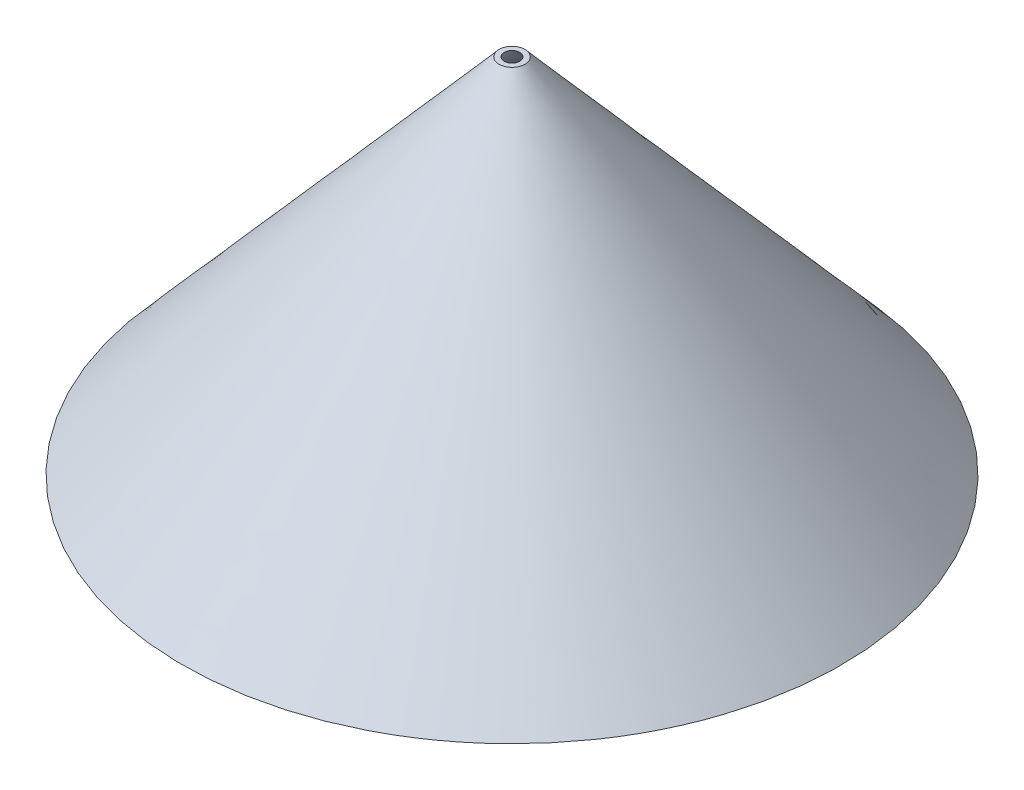
ISO-10303-21;
HEADER;
FILE_DESCRIPTION(('STEP AP214'),'2;1');
FILE_NAME('part.step','',(''),(''),'','','');
FILE_SCHEMA(('AUTOMOTIVE_DESIGN { 1 0 10303 214 1 1 1 1 }'));
ENDSEC;
DATA;
#1=APPLICATION_CONTEXT('core data for automotive mechanical design processes');
#2=APPLICATION_PROTOCOL_DEFINITION('international standard','automotive_design',2000,#1);
#3=PRODUCT_CONTEXT('',#1,'mechanical');
#4=PRODUCT('Part','Part','',(#3));
#5=PRODUCT_RELATED_PRODUCT_CATEGORY('part','',(#4));
#6=PRODUCT_DEFINITION_FORMATION('','',#4);
#7=PRODUCT_DEFINITION_CONTEXT('part definition',#1,'design');
#8=PRODUCT_DEFINITION('design','',#6,#7);
#9=PRODUCT_DEFINITION_SHAPE('','',#8);
#10=(LENGTH_UNIT() NAMED_UNIT(*) SI_UNIT(.MILLI.,.METRE.));
#11=(NAMED_UNIT(*) PLANE_ANGLE_UNIT() SI_UNIT($,.RADIAN.));
#12=(NAMED_UNIT(*) SI_UNIT($,.STERADIAN.) SOLID_ANGLE_UNIT());
#13=UNCERTAINTY_MEASURE_WITH_UNIT(LENGTH_MEASURE(1.E-05),#10,'distance_accuracy_value','');
#14=(GEOMETRIC_REPRESENTATION_CONTEXT(3) GLOBAL_UNCERTAINTY_ASSIGNED_CONTEXT((#13)) GLOBAL_UNIT_ASSIGNED_CONTEXT((#10,
#11,#12)) REPRESENTATION_CONTEXT('',''));
#15=CARTESIAN_POINT('',(0.,0.,0.));
#16=DIRECTION('',(0.,0.,1.));
#17=DIRECTION('',(1.,0.,0.));
#18=AXIS2_PLACEMENT_3D('',#15,#16,#17);
#19=CARTESIAN_POINT('',(0.,0.,0.));
#20=DIRECTION('',(0.,1.,0.));
#21=DIRECTION('',(0.,0.,1.));
#22=AXIS2_PLACEMENT_3D('',#19,#20,#21);
#23=PLANE('',#22);
#24=CARTESIAN_POINT('',(0.,0.,0.));
#25=DIRECTION('',(0.,1.,0.));
#26=DIRECTION('',(0.,0.,1.));
#27=AXIS2_PLACEMENT_3D('',#24,#25,#26);
#28=CIRCLE('',#27,123.);
#29=CARTESIAN_POINT('',(113.279055893445,0.,-47.9255202985821));
#30=VERTEX_POINT('',#29);
#31=EDGE_CURVE('E117',#30,#30,#28,.T.);
#32=ORIENTED_EDGE('',*,*,#31,.T.);
#33=EDGE_LOOP('',(#32));
#34=FACE_BOUND('',#33,.T.);
#35=CARTESIAN_POINT('',(0.,0.,0.));
#36=DIRECTION('',(0.,1.,0.));
#37=DIRECTION('',(0.,0.,1.));
#38=AXIS2_PLACEMENT_3D('',#35,#36,#37);
#39=CIRCLE('',#38,127.5);
#40=CARTESIAN_POINT('',(-97.1076713271725,0.,-82.6217294022211));
#41=VERTEX_POINT('',#40);
#42=EDGE_CURVE('E11',#41,#41,#39,.T.);
#43=ORIENTED_EDGE('',*,*,#42,.F.);
#44=EDGE_LOOP('',(#43));
#45=FACE_BOUND('',#44,.T.);
#46=ADVANCED_FACE('F47',(#34,#45),#23,.F.);
#47=CARTESIAN_POINT('',(0.,140.,0.));
#48=DIRECTION('',(0.,1.,0.));
#49=DIRECTION('',(0.,0.,1.));
#50=AXIS2_PLACEMENT_3D('',#47,#48,#49);
#51=PLANE('',#50);
#52=CARTESIAN_POINT('',(0.,140.,0.));
#53=DIRECTION('',(0.,1.,0.));
#54=DIRECTION('',(0.,0.,1.));
#55=AXIS2_PLACEMENT_3D('',#52,#53,#54);
#56=CIRCLE('',#55,3.);
#57=CARTESIAN_POINT('',(1.46832999742992,140.,-2.61610531489989));
#58=VERTEX_POINT('',#57);
#59=EDGE_CURVE('E64',#58,#58,#56,.T.);
#60=ORIENTED_EDGE('',*,*,#59,.F.);
#61=EDGE_LOOP('',(#60));
#62=FACE_BOUND('',#61,.T.);
#63=CARTESIAN_POINT('',(0.,140.,0.));
#64=DIRECTION('',(0.,1.,0.));
#65=DIRECTION('',(0.,0.,1.));
#66=AXIS2_PLACEMENT_3D('',#63,#64,#65);
#67=CIRCLE('',#66,5.);
#68=CARTESIAN_POINT('',(-4.43923755489334,140.,-2.30068901227971));
#69=VERTEX_POINT('',#68);
#70=EDGE_CURVE('E57',#69,#69,#67,.T.);
#71=ORIENTED_EDGE('',*,*,#70,.T.);
#72=EDGE_LOOP('',(#71));
#73=FACE_BOUND('',#72,.T.);
#74=ADVANCED_FACE('F81',(#62,#73),#51,.T.);
#75=CARTESIAN_POINT('',(-4.43923755489334,140.,-2.30068901227971));
#76=CARTESIAN_POINT('',(-97.1076713271725,0.,-82.6217294022211));
#77=CARTESIAN_POINT('',(0.162140469666065,140.,-11.1791641220664));
#78=CARTESIAN_POINT('',(68.1357874772697,0.,-276.837072056566));
#79=CARTESIAN_POINT('',(9.04061557945275,140.,-6.57778609750698));
#80=CARTESIAN_POINT('',(262.351130131615,0.,-111.593613252124));
#81=CARTESIAN_POINT('',(4.43923755489334,140.,2.3006890122797));
#82=CARTESIAN_POINT('',(97.1076713271725,0.,82.6217294022211));
#83=CARTESIAN_POINT('',(-0.162140469666064,140.,11.1791641220664));
#84=CARTESIAN_POINT('',(-68.1357874772696,0.,276.837072056566));
#85=CARTESIAN_POINT('',(-9.04061557945275,140.,6.57778609750698));
#86=CARTESIAN_POINT('',(-262.351130131615,0.,111.593613252124));
#87=CARTESIAN_POINT('',(-4.43923755489334,140.,-2.30068901227971));
#88=CARTESIAN_POINT('',(-97.1076713271725,0.,-82.6217294022211));
#89=(BOUNDED_SURFACE() B_SPLINE_SURFACE(3,1,((#75,#76),(#77,#78),(#79,#80),(#81,#82),(#83,#84),
(#85,#86),(#87,#88)),.UNSPECIFIED.,.T.,.F.,.F.) B_SPLINE_SURFACE_WITH_KNOTS((4,3,4),(2,2),(0.,
0.5,1.),(0.,1.),.UNSPECIFIED.) GEOMETRIC_REPRESENTATION_ITEM() RATIONAL_B_SPLINE_SURFACE(((1.,
1.),(0.333333333333333,0.333333333333333),(0.333333333333333,0.333333333333333),(1.,1.),
(0.333333333333333,0.333333333333333),(0.333333333333333,0.333333333333333),(1.,1.))) REPRESENTATION_ITEM('') SURFACE());
#90=CARTESIAN_POINT('',(-4.43923755489334,140.,-2.30068901227971));
#91=CARTESIAN_POINT('',(-5.40453374002126,138.541666666667,-3.1373665163416));
#92=CARTESIAN_POINT('',(-6.36982992514916,137.083333333333,-3.97404402040349));
#93=CARTESIAN_POINT('',(-8.30042229540497,134.166666666667,-5.64739902852726));
#94=CARTESIAN_POINT('',(-9.26571848053288,132.708333333333,-6.48407653258915));
#95=CARTESIAN_POINT('',(-11.1963108507887,129.791666666667,-8.15743154071293));
#96=CARTESIAN_POINT('',(-12.1616070359166,128.333333333333,-8.99410904477482));
#97=CARTESIAN_POINT('',(-14.0921994061724,125.416666666667,-10.6674640528986));
#98=CARTESIAN_POINT('',(-15.0574955913003,123.958333333333,-11.5041415569605));
#99=CARTESIAN_POINT('',(-16.9880879615561,121.041666666667,-13.1774965650843));
#100=CARTESIAN_POINT('',(-17.9533841466841,119.583333333333,-14.0141740691462));
#101=CARTESIAN_POINT('',(-19.8839765169399,116.666666666667,-15.6875290772699));
#102=CARTESIAN_POINT('',(-20.8492727020678,115.208333333333,-16.5242065813318));
#103=CARTESIAN_POINT('',(-22.7798650723236,112.291666666667,-18.1975615894556));
#104=CARTESIAN_POINT('',(-23.7451612574515,110.833333333333,-19.0342390935175));
#105=CARTESIAN_POINT('',(-25.6757536277073,107.916666666667,-20.7075941016413));
#106=CARTESIAN_POINT('',(-26.6410498128352,106.458333333333,-21.5442716057032));
#107=CARTESIAN_POINT('',(-28.571642183091,103.541666666667,-23.2176266138269));
#108=CARTESIAN_POINT('',(-29.5369383682189,102.083333333333,-24.0543041178888));
#109=CARTESIAN_POINT('',(-31.4675307384748,99.1666666666667,-25.7276591260126));
#110=CARTESIAN_POINT('',(-32.4328269236027,97.7083333333333,-26.5643366300745));
#111=CARTESIAN_POINT('',(-34.3634192938585,94.7916666666667,-28.2376916381983));
#112=CARTESIAN_POINT('',(-35.3287154789864,93.3333333333333,-29.0743691422602));
#113=CARTESIAN_POINT('',(-37.2593078492422,90.4166666666667,-30.7477241503839));
#114=CARTESIAN_POINT('',(-38.2246040343701,88.9583333333333,-31.5844016544458));
#115=CARTESIAN_POINT('',(-40.1551964046259,86.0416666666667,-33.2577566625696));
#116=CARTESIAN_POINT('',(-41.1204925897538,84.5833333333333,-34.0944341666315));
#117=CARTESIAN_POINT('',(-43.0510849600096,81.6666666666667,-35.7677891747553));
#118=CARTESIAN_POINT('',(-44.0163811451376,80.2083333333333,-36.6044666788172));
#119=CARTESIAN_POINT('',(-45.9469735153934,77.2916666666667,-38.277821686941));
#120=CARTESIAN_POINT('',(-46.9122697005213,75.8333333333333,-39.1144991910028));
#121=CARTESIAN_POINT('',(-48.8428620707771,72.9166666666667,-40.7878541991266));
#122=CARTESIAN_POINT('',(-49.808158255905,71.4583333333333,-41.6245317031885));
#123=CARTESIAN_POINT('',(-51.7387506261608,68.5416666666667,-43.2978867113123));
#124=CARTESIAN_POINT('',(-52.7040468112887,67.0833333333333,-44.1345642153742));
#125=CARTESIAN_POINT('',(-54.6346391815445,64.1666666666667,-45.807919223498));
#126=CARTESIAN_POINT('',(-55.5999353666724,62.7083333333333,-46.6445967275599));
#127=CARTESIAN_POINT('',(-57.5305277369283,59.7916666666667,-48.3179517356836));
#128=CARTESIAN_POINT('',(-58.4958239220562,58.3333333333333,-49.1546292397455));
#129=CARTESIAN_POINT('',(-60.426416292312,55.4166666666667,-50.8279842478693));
#130=CARTESIAN_POINT('',(-61.3917124774399,53.9583333333333,-51.6646617519312));
#131=CARTESIAN_POINT('',(-63.3223048476957,51.0416666666667,-53.338016760055));
#132=CARTESIAN_POINT('',(-64.2876010328236,49.5833333333333,-54.1746942641169));
#133=CARTESIAN_POINT('',(-66.2181934030794,46.6666666666667,-55.8480492722406));
#134=CARTESIAN_POINT('',(-67.1834895882073,45.2083333333333,-56.6847267763025));
#135=CARTESIAN_POINT('',(-69.1140819584631,42.2916666666667,-58.3580817844263));
#136=CARTESIAN_POINT('',(-70.0793781435911,40.8333333333333,-59.1947592884882));
#137=CARTESIAN_POINT('',(-72.0099705138469,37.9166666666667,-60.868114296612));
#138=CARTESIAN_POINT('',(-72.9752666989748,36.4583333333333,-61.7047918006739));
#139=CARTESIAN_POINT('',(-74.9058590692306,33.5416666666667,-63.3781468087976));
#140=CARTESIAN_POINT('',(-75.8711552543585,32.0833333333333,-64.2148243128595));
#141=CARTESIAN_POINT('',(-77.8017476246143,29.1666666666667,-65.8881793209833));
#142=CARTESIAN_POINT('',(-78.7670438097422,27.7083333333333,-66.7248568250452));
#143=CARTESIAN_POINT('',(-80.697636179998,24.7916666666667,-68.398211833169));
#144=CARTESIAN_POINT('',(-81.662932365126,23.3333333333333,-69.2348893372309));
#145=CARTESIAN_POINT('',(-83.5935247353818,20.4166666666667,-70.9082443453546));
#146=CARTESIAN_POINT('',(-84.5588209205097,18.9583333333333,-71.7449218494165));
#147=CARTESIAN_POINT('',(-86.4894132907655,16.0416666666667,-73.4182768575403));
#148=CARTESIAN_POINT('',(-87.4547094758934,14.5833333333333,-74.2549543616022));
#149=CARTESIAN_POINT('',(-89.3853018461492,11.6666666666667,-75.928309369726));
#150=CARTESIAN_POINT('',(-90.3505980312771,10.2083333333333,-76.7649868737879));
#151=CARTESIAN_POINT('',(-92.2811904015329,7.29166666666667,-78.4383418819117));
#152=CARTESIAN_POINT('',(-93.2464865866609,5.83333333333333,-79.2750193859735));
#153=CARTESIAN_POINT('',(-95.1770789569167,2.91666666666667,-80.9483743940973));
#154=CARTESIAN_POINT('',(-96.1423751420446,1.45833333333334,-81.7850518981592));
#155=CARTESIAN_POINT('',(-97.1076713271725,0.,-82.6217294022211));
#156=B_SPLINE_CURVE_WITH_KNOTS('',3,(#90,#91,#92,#93,#94,#95,#96,#97,#98,#99,#100,#101,#102,
#103,#104,#105,#106,#107,#108,#109,#110,#111,#112,#113,#114,#115,#116,#117,#118,#119,#120,#121,
#122,#123,#124,#125,#126,#127,#128,#129,#130,#131,#132,#133,#134,#135,#136,#137,#138,#139,#140,
#141,#142,#143,#144,#145,#146,#147,#148,#149,#150,#151,#152,#153,#154,#155),.UNSPECIFIED.,.F.,
.F.,(4,2,2,2,2,2,2,2,2,2,2,2,2,2,2,2,2,2,2,2,2,2,2,2,2,2,2,2,2,2,2,2,4),(0.,5.81610339810353,
11.6322067962071,17.4483101943106,23.2644135924142,29.0805169905177,34.8966203886212,
40.7127237867248,46.5288271848283,52.3449305829318,58.1610339810354,63.9771373791389,
69.7932407772424,75.609344175346,81.4254475734495,87.2415509715531,93.0576543696566,
98.8737577677601,104.689861165864,110.505964563967,116.322067962071,122.138171360174,
127.954274758278,133.770378156381,139.586481554485,145.402584952588,151.218688350692,
157.034791748796,162.850895146899,168.666998545003,174.483101943106,180.29920534121,
186.115308739313),.UNSPECIFIED.);
#157=EDGE_CURVE('BSEAM90',#69,#41,#156,.T.);
#158=ORIENTED_EDGE('',*,*,#70,.F.);
#159=ORIENTED_EDGE('',*,*,#42,.T.);
#160=ORIENTED_EDGE('',*,*,#157,.T.);
#161=ORIENTED_EDGE('',*,*,#157,.F.);
#162=EDGE_LOOP('',(#158,#160,#159,#161));
#163=FACE_BOUND('',#162,.T.);
#164=ADVANCED_FACE('F90',(#163),#89,.T.);
#165=CARTESIAN_POINT('',(113.279055893445,0.,-47.9255202985821));
#166=CARTESIAN_POINT('',(1.46832999742992,140.,-2.61610531489989));
#167=CARTESIAN_POINT('',(17.4280152962806,0.,-274.483632085472));
#168=CARTESIAN_POINT('',(-3.76388063236986,140.,-5.55276530975972));
#169=CARTESIAN_POINT('',(-209.130096490609,0.,-178.632591488307));
#170=CARTESIAN_POINT('',(-6.7005406272297,140.,-0.320554679959947));
#171=CARTESIAN_POINT('',(-113.279055893445,0.,47.9255202985821));
#172=CARTESIAN_POINT('',(-1.46832999742992,140.,2.61610531489989));
#173=CARTESIAN_POINT('',(-17.4280152962805,0.,274.483632085472));
#174=CARTESIAN_POINT('',(3.76388063236986,140.,5.55276530975973));
#175=CARTESIAN_POINT('',(209.130096490609,0.,178.632591488307));
#176=CARTESIAN_POINT('',(6.7005406272297,140.,0.320554679959949));
#177=CARTESIAN_POINT('',(113.279055893445,0.,-47.9255202985821));
#178=CARTESIAN_POINT('',(1.46832999742992,140.,-2.61610531489989));
#179=(BOUNDED_SURFACE() B_SPLINE_SURFACE(3,1,((#165,#166),(#167,#168),(#169,#170),(#171,#172),
(#173,#174),(#175,#176),(#177,#178)),.UNSPECIFIED.,.T.,.F.,.F.) B_SPLINE_SURFACE_WITH_KNOTS((4,
3,4),(2,2),(0.,0.5,1.),(0.,1.),
.UNSPECIFIED.) GEOMETRIC_REPRESENTATION_ITEM() RATIONAL_B_SPLINE_SURFACE(((1.,1.),
(0.333333333333333,0.333333333333334),(0.333333333333333,0.333333333333334),(1.,1.),
(0.333333333333333,0.333333333333333),(0.333333333333333,0.333333333333333),(1.,1.))) REPRESENTATION_ITEM('') SURFACE());
#180=CARTESIAN_POINT('',(113.279055893445,0.,-47.9255202985821));
#181=CARTESIAN_POINT('',(112.114360832028,1.45833333333333,-47.4535472258354));
#182=CARTESIAN_POINT('',(110.949665770611,2.91666666666667,-46.9815741530888));
#183=CARTESIAN_POINT('',(108.620275647778,5.83333333333333,-46.0376280075954));
#184=CARTESIAN_POINT('',(107.455580586361,7.29166666666667,-45.5656549348487));
#185=CARTESIAN_POINT('',(105.126190463527,10.2083333333333,-44.6217087893553));
#186=CARTESIAN_POINT('',(103.96149540211,11.6666666666667,-44.1497357166086));
#187=CARTESIAN_POINT('',(101.632105279277,14.5833333333333,-43.2057895711152));
#188=CARTESIAN_POINT('',(100.46741021786,16.0416666666667,-42.7338164983685));
#189=CARTESIAN_POINT('',(98.1380200950261,18.9583333333333,-41.7898703528752));
#190=CARTESIAN_POINT('',(96.9733250336093,20.4166666666667,-41.3178972801285));
#191=CARTESIAN_POINT('',(94.6439349107757,23.3333333333333,-40.3739511346351));
#192=CARTESIAN_POINT('',(93.4792398493588,24.7916666666667,-39.9019780618884));
#193=CARTESIAN_POINT('',(91.1498497265252,27.7083333333333,-38.958031916395));
#194=CARTESIAN_POINT('',(89.9851546651084,29.1666666666667,-38.4860588436483));
#195=CARTESIAN_POINT('',(87.6557645422747,32.0833333333333,-37.542112698155));
#196=CARTESIAN_POINT('',(86.4910694808579,33.5416666666667,-37.0701396254083));
#197=CARTESIAN_POINT('',(84.1616793580243,36.4583333333333,-36.1261934799149));
#198=CARTESIAN_POINT('',(82.9969842966074,37.9166666666667,-35.6542204071682));
#199=CARTESIAN_POINT('',(80.6675941737738,40.8333333333333,-34.7102742616748));
#200=CARTESIAN_POINT('',(79.502899112357,42.2916666666667,-34.2383011889281));
#201=CARTESIAN_POINT('',(77.1735089895233,45.2083333333333,-33.2943550434347));
#202=CARTESIAN_POINT('',(76.0088139281065,46.6666666666667,-32.822381970688));
#203=CARTESIAN_POINT('',(73.6794238052729,49.5833333333333,-31.8784358251947));
#204=CARTESIAN_POINT('',(72.5147287438561,51.0416666666667,-31.406462752448));
#205=CARTESIAN_POINT('',(70.1853386210224,53.9583333333333,-30.4625166069546));
#206=CARTESIAN_POINT('',(69.0206435596056,55.4166666666667,-29.9905435342079));
#207=CARTESIAN_POINT('',(66.6912534367719,58.3333333333333,-29.0465973887145));
#208=CARTESIAN_POINT('',(65.5265583753551,59.7916666666667,-28.5746243159678));
#209=CARTESIAN_POINT('',(63.1971682525215,62.7083333333333,-27.6306781704745));
#210=CARTESIAN_POINT('',(62.0324731911047,64.1666666666667,-27.1587050977278));
#211=CARTESIAN_POINT('',(59.703083068271,67.0833333333333,-26.2147589522344));
#212=CARTESIAN_POINT('',(58.5383880068542,68.5416666666667,-25.7427858794877));
#213=CARTESIAN_POINT('',(56.2089978840205,71.4583333333333,-24.7988397339943));
#214=CARTESIAN_POINT('',(55.0443028226037,72.9166666666667,-24.3268666612476));
#215=CARTESIAN_POINT('',(52.7149126997701,75.8333333333333,-23.3829205157543));
#216=CARTESIAN_POINT('',(51.5502176383533,77.2916666666667,-22.9109474430076));
#217=CARTESIAN_POINT('',(49.2208275155196,80.2083333333333,-21.9670012975142));
#218=CARTESIAN_POINT('',(48.0561324541028,81.6666666666667,-21.4950282247675));
#219=CARTESIAN_POINT('',(45.7267423312692,84.5833333333333,-20.5510820792741));
#220=CARTESIAN_POINT('',(44.5620472698523,86.0416666666667,-20.0791090065274));
#221=CARTESIAN_POINT('',(42.2326571470187,88.9583333333333,-19.135162861034));
#222=CARTESIAN_POINT('',(41.0679620856019,90.4166666666667,-18.6631897882874));
#223=CARTESIAN_POINT('',(38.7385719627682,93.3333333333333,-17.719243642794));
#224=CARTESIAN_POINT('',(37.5738769013514,94.7916666666667,-17.2472705700473));
#225=CARTESIAN_POINT('',(35.2444867785178,97.7083333333333,-16.3033244245539));
#226=CARTESIAN_POINT('',(34.0797917171009,99.1666666666667,-15.8313513518072));
#227=CARTESIAN_POINT('',(31.7504015942673,102.083333333333,-14.8874052063138));
#228=CARTESIAN_POINT('',(30.5857065328505,103.541666666667,-14.4154321335671));
#229=CARTESIAN_POINT('',(28.2563164100168,106.458333333333,-13.4714859880738));
#230=CARTESIAN_POINT('',(27.0916213486,107.916666666667,-12.9995129153271));
#231=CARTESIAN_POINT('',(24.7622312257664,110.833333333333,-12.0555667698337));
#232=CARTESIAN_POINT('',(23.5975361643495,112.291666666667,-11.583593697087));
#233=CARTESIAN_POINT('',(21.2681460415159,115.208333333333,-10.6396475515936));
#234=CARTESIAN_POINT('',(20.1034509800991,116.666666666667,-10.1676744788469));
#235=CARTESIAN_POINT('',(17.7740608572654,119.583333333333,-9.22372833335355));
#236=CARTESIAN_POINT('',(16.6093657958486,121.041666666667,-8.75175526060686));
#237=CARTESIAN_POINT('',(14.279975673015,123.958333333333,-7.80780911511348));
#238=CARTESIAN_POINT('',(13.1152806115981,125.416666666667,-7.33583604236679));
#239=CARTESIAN_POINT('',(10.7858904887645,128.333333333333,-6.39188989687341));
#240=CARTESIAN_POINT('',(9.62119542734767,129.791666666667,-5.91991682412672));
#241=CARTESIAN_POINT('',(7.29180530451403,132.708333333333,-4.97597067863334));
#242=CARTESIAN_POINT('',(6.12711024309721,134.166666666667,-4.50399760588665));
#243=CARTESIAN_POINT('',(3.79772012026357,137.083333333333,-3.56005146039327));
#244=CARTESIAN_POINT('',(2.63302505884675,138.541666666667,-3.08807838764658));
#245=CARTESIAN_POINT('',(1.46832999742992,140.,-2.61610531489989));
#246=B_SPLINE_CURVE_WITH_KNOTS('',3,(#180,#181,#182,#183,#184,#185,#186,#187,#188,#189,#190,
#191,#192,#193,#194,#195,#196,#197,#198,#199,#200,#201,#202,#203,#204,#205,#206,#207,#208,#209,
#210,#211,#212,#213,#214,#215,#216,#217,#218,#219,#220,#221,#222,#223,#224,#225,#226,#227,#228,
#229,#230,#231,#232,#233,#234,#235,#236,#237,#238,#239,#240,#241,#242,#243,#244,#245),
.UNSPECIFIED.,.F.,.F.,(4,2,2,2,2,2,2,2,2,2,2,2,2,2,2,2,2,2,2,2,2,2,2,2,2,2,2,2,2,2,2,2,4),(0.,
5.77529943010579,11.5505988602116,17.3258982903174,23.1011977204231,28.8764971505289,
34.6517965806347,40.4270960107405,46.2023954408463,51.9776948709521,57.7529943010578,
63.5282937311636,69.3035931612694,75.0788925913752,80.854192021481,86.6294914515867,
92.4047908816925,98.1800903117983,103.955389741904,109.73068917201,115.505988602116,
121.281288032221,127.056587462327,132.831886892433,138.607186322539,144.382485752645,
150.15778518275,155.933084612856,161.708384042962,167.483683473068,173.258982903174,
179.034282333279,184.809581763385),.UNSPECIFIED.);
#247=EDGE_CURVE('BSEAM91',#30,#58,#246,.T.);
#248=ORIENTED_EDGE('',*,*,#31,.F.);
#249=ORIENTED_EDGE('',*,*,#59,.T.);
#250=ORIENTED_EDGE('',*,*,#247,.T.);
#251=ORIENTED_EDGE('',*,*,#247,.F.);
#252=EDGE_LOOP('',(#248,#250,#249,#251));
#253=FACE_BOUND('',#252,.T.);
#254=ADVANCED_FACE('F91',(#253),#179,.F.);
#255=CLOSED_SHELL('',(#46,#74,#164,#254));
#256=MANIFOLD_SOLID_BREP('B2',#255);
#257=ADVANCED_BREP_SHAPE_REPRESENTATION('',(#18,#256),#14);
#258=SHAPE_DEFINITION_REPRESENTATION(#9,#257);
ENDSEC;
END-ISO-10303-21;
